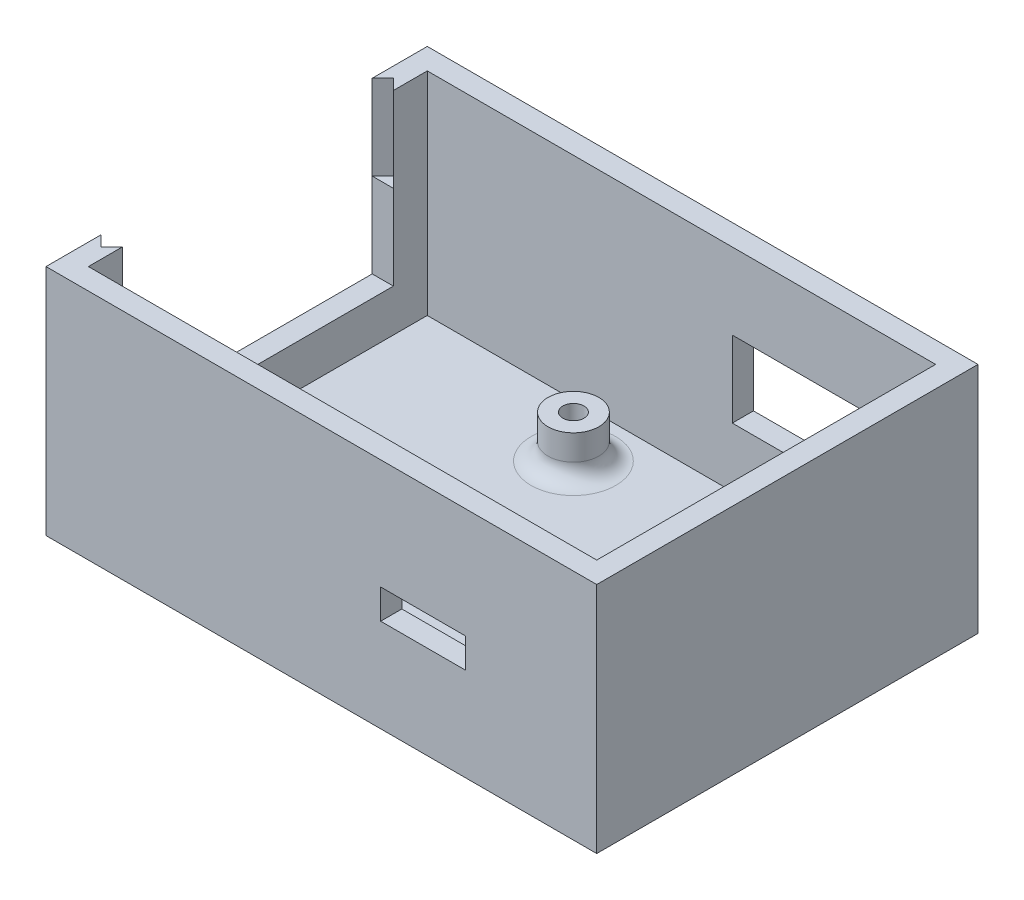
ISO-10303-21;
HEADER;
FILE_DESCRIPTION(('STEP AP214'),'2;1');
FILE_NAME('part.step','',(''),(''),'','','');
FILE_SCHEMA(('AUTOMOTIVE_DESIGN { 1 0 10303 214 1 1 1 1 }'));
ENDSEC;
DATA;
#1=APPLICATION_CONTEXT('core data for automotive mechanical design processes');
#2=APPLICATION_PROTOCOL_DEFINITION('international standard','automotive_design',2000,#1);
#3=PRODUCT_CONTEXT('',#1,'mechanical');
#4=PRODUCT('Part','Part','',(#3));
#5=PRODUCT_RELATED_PRODUCT_CATEGORY('part','',(#4));
#6=PRODUCT_DEFINITION_FORMATION('','',#4);
#7=PRODUCT_DEFINITION_CONTEXT('part definition',#1,'design');
#8=PRODUCT_DEFINITION('design','',#6,#7);
#9=PRODUCT_DEFINITION_SHAPE('','',#8);
#10=(LENGTH_UNIT() NAMED_UNIT(*) SI_UNIT(.MILLI.,.METRE.));
#11=(NAMED_UNIT(*) PLANE_ANGLE_UNIT() SI_UNIT($,.RADIAN.));
#12=(NAMED_UNIT(*) SI_UNIT($,.STERADIAN.) SOLID_ANGLE_UNIT());
#13=UNCERTAINTY_MEASURE_WITH_UNIT(LENGTH_MEASURE(1.E-05),#10,'distance_accuracy_value','');
#14=(GEOMETRIC_REPRESENTATION_CONTEXT(3) GLOBAL_UNCERTAINTY_ASSIGNED_CONTEXT((#13)) GLOBAL_UNIT_ASSIGNED_CONTEXT((#10,
#11,#12)) REPRESENTATION_CONTEXT('',''));
#15=CARTESIAN_POINT('',(0.,0.,0.));
#16=DIRECTION('',(0.,0.,1.));
#17=DIRECTION('',(1.,0.,0.));
#18=AXIS2_PLACEMENT_3D('',#15,#16,#17);
#19=CARTESIAN_POINT('',(32.5,27.5,-22.5));
#20=DIRECTION('',(-1.,0.,0.));
#21=DIRECTION('',(0.,0.,1.));
#22=AXIS2_PLACEMENT_3D('',#19,#20,#21);
#23=PLANE('',#22);
#24=DIRECTION('',(0.,0.,-1.));
#25=VECTOR('',#24,1.);
#26=CARTESIAN_POINT('',(32.5,0.,-22.5));
#27=LINE('',#26,#25);
#28=CARTESIAN_POINT('',(32.5,0.,22.5));
#29=VERTEX_POINT('',#28);
#30=CARTESIAN_POINT('',(32.5,0.,-22.5));
#31=VERTEX_POINT('',#30);
#32=EDGE_CURVE('E355',#29,#31,#27,.T.);
#33=ORIENTED_EDGE('',*,*,#32,.T.);
#34=DIRECTION('',(0.,-1.,0.));
#35=VECTOR('',#34,1.);
#36=CARTESIAN_POINT('',(32.5,27.5,-22.5));
#37=LINE('',#36,#35);
#38=CARTESIAN_POINT('',(32.5,27.5,-22.5));
#39=VERTEX_POINT('',#38);
#40=EDGE_CURVE('E408',#39,#31,#37,.T.);
#41=ORIENTED_EDGE('',*,*,#40,.F.);
#42=DIRECTION('',(0.,0.,-1.));
#43=VECTOR('',#42,1.);
#44=CARTESIAN_POINT('',(32.5,27.5,-22.5));
#45=LINE('',#44,#43);
#46=CARTESIAN_POINT('',(32.5,27.5,22.5));
#47=VERTEX_POINT('',#46);
#48=EDGE_CURVE('E380',#47,#39,#45,.T.);
#49=ORIENTED_EDGE('',*,*,#48,.F.);
#50=DIRECTION('',(0.,-1.,0.));
#51=VECTOR('',#50,1.);
#52=CARTESIAN_POINT('',(32.5,27.5,22.5));
#53=LINE('',#52,#51);
#54=EDGE_CURVE('E392',#47,#29,#53,.T.);
#55=ORIENTED_EDGE('',*,*,#54,.T.);
#56=EDGE_LOOP('',(#33,#41,#49,#55));
#57=FACE_BOUND('',#56,.T.);
#58=ADVANCED_FACE('F41',(#57),#23,.F.);
#59=CARTESIAN_POINT('',(-32.5,27.5,-22.5));
#60=DIRECTION('',(0.,0.,1.));
#61=DIRECTION('',(1.,0.,0.));
#62=AXIS2_PLACEMENT_3D('',#59,#60,#61);
#63=PLANE('',#62);
#64=DIRECTION('',(1.,0.,0.));
#65=VECTOR('',#64,1.);
#66=CARTESIAN_POINT('',(28.,9.5,-22.5));
#67=LINE('',#66,#65);
#68=CARTESIAN_POINT('',(6.00000000000001,9.5,-22.5));
#69=VERTEX_POINT('',#68);
#70=CARTESIAN_POINT('',(28.,9.5,-22.5));
#71=VERTEX_POINT('',#70);
#72=EDGE_CURVE('E249',#69,#71,#67,.T.);
#73=ORIENTED_EDGE('',*,*,#72,.T.);
#74=DIRECTION('',(0.,1.,0.));
#75=VECTOR('',#74,1.);
#76=CARTESIAN_POINT('',(28.,18.5,-22.5));
#77=LINE('',#76,#75);
#78=CARTESIAN_POINT('',(28.,18.5,-22.5));
#79=VERTEX_POINT('',#78);
#80=EDGE_CURVE('E239',#71,#79,#77,.T.);
#81=ORIENTED_EDGE('',*,*,#80,.T.);
#82=DIRECTION('',(-1.,0.,0.));
#83=VECTOR('',#82,1.);
#84=CARTESIAN_POINT('',(28.,18.5,-22.5));
#85=LINE('',#84,#83);
#86=CARTESIAN_POINT('',(6.00000000000001,18.5,-22.5));
#87=VERTEX_POINT('',#86);
#88=EDGE_CURVE('E242',#79,#87,#85,.T.);
#89=ORIENTED_EDGE('',*,*,#88,.T.);
#90=DIRECTION('',(0.,-1.,0.));
#91=VECTOR('',#90,1.);
#92=CARTESIAN_POINT('',(6.,18.5,-22.5));
#93=LINE('',#92,#91);
#94=EDGE_CURVE('E246',#87,#69,#93,.T.);
#95=ORIENTED_EDGE('',*,*,#94,.T.);
#96=EDGE_LOOP('',(#73,#81,#89,#95));
#97=FACE_BOUND('',#96,.T.);
#98=DIRECTION('',(-1.,0.,0.));
#99=VECTOR('',#98,1.);
#100=CARTESIAN_POINT('',(-32.5,0.,-22.5));
#101=LINE('',#100,#99);
#102=CARTESIAN_POINT('',(-32.5,0.,-22.5));
#103=VERTEX_POINT('',#102);
#104=EDGE_CURVE('E395',#31,#103,#101,.T.);
#105=ORIENTED_EDGE('',*,*,#104,.T.);
#106=DIRECTION('',(0.,-1.,0.));
#107=VECTOR('',#106,1.);
#108=CARTESIAN_POINT('',(-32.5,27.5,-22.5));
#109=LINE('',#108,#107);
#110=CARTESIAN_POINT('',(-32.5,27.5,-22.5));
#111=VERTEX_POINT('',#110);
#112=EDGE_CURVE('E405',#111,#103,#109,.T.);
#113=ORIENTED_EDGE('',*,*,#112,.F.);
#114=DIRECTION('',(-1.,0.,0.));
#115=VECTOR('',#114,1.);
#116=CARTESIAN_POINT('',(-32.5,27.5,-22.5));
#117=LINE('',#116,#115);
#118=EDGE_CURVE('E383',#39,#111,#117,.T.);
#119=ORIENTED_EDGE('',*,*,#118,.F.);
#120=ORIENTED_EDGE('',*,*,#40,.T.);
#121=EDGE_LOOP('',(#105,#113,#119,#120));
#122=FACE_BOUND('',#121,.T.);
#123=ADVANCED_FACE('F450',(#97,#122),#63,.F.);
#124=CARTESIAN_POINT('',(-32.5,27.5,-22.5));
#125=DIRECTION('',(1.,0.,0.));
#126=DIRECTION('',(0.,0.,-1.));
#127=AXIS2_PLACEMENT_3D('',#124,#125,#126);
#128=PLANE('',#127);
#129=DIRECTION('',(0.,0.,-1.));
#130=VECTOR('',#129,1.);
#131=CARTESIAN_POINT('',(-32.5,7.5,-16.));
#132=LINE('',#131,#130);
#133=CARTESIAN_POINT('',(-32.5,7.5,16.));
#134=VERTEX_POINT('',#133);
#135=CARTESIAN_POINT('',(-32.5,7.5,-16.));
#136=VERTEX_POINT('',#135);
#137=EDGE_CURVE('E333',#134,#136,#132,.T.);
#138=ORIENTED_EDGE('',*,*,#137,.T.);
#139=DIRECTION('',(0.,1.,0.));
#140=VECTOR('',#139,1.);
#141=CARTESIAN_POINT('',(-32.5,27.5,-16.));
#142=LINE('',#141,#140);
#143=CARTESIAN_POINT('',(-32.5,17.5,-16.));
#144=VERTEX_POINT('',#143);
#145=EDGE_CURVE('E325',#136,#144,#142,.T.);
#146=ORIENTED_EDGE('',*,*,#145,.T.);
#147=DIRECTION('',(0.,1.,0.));
#148=VECTOR('',#147,1.);
#149=CARTESIAN_POINT('',(-32.5,4.70491502812523,-16.));
#150=LINE('',#149,#148);
#151=CARTESIAN_POINT('',(-32.5,27.5,-16.));
#152=VERTEX_POINT('',#151);
#153=EDGE_CURVE('E303',#144,#152,#150,.T.);
#154=ORIENTED_EDGE('',*,*,#153,.T.);
#155=DIRECTION('',(0.,0.,1.));
#156=VECTOR('',#155,1.);
#157=CARTESIAN_POINT('',(-32.5,27.5,-22.5));
#158=LINE('',#157,#156);
#159=EDGE_CURVE('E387',#111,#152,#158,.T.);
#160=ORIENTED_EDGE('',*,*,#159,.F.);
#161=ORIENTED_EDGE('',*,*,#112,.T.);
#162=DIRECTION('',(0.,0.,1.));
#163=VECTOR('',#162,1.);
#164=CARTESIAN_POINT('',(-32.5,0.,-22.5));
#165=LINE('',#164,#163);
#166=CARTESIAN_POINT('',(-32.5,0.,22.5));
#167=VERTEX_POINT('',#166);
#168=EDGE_CURVE('E397',#103,#167,#165,.T.);
#169=ORIENTED_EDGE('',*,*,#168,.T.);
#170=DIRECTION('',(0.,-1.,0.));
#171=VECTOR('',#170,1.);
#172=CARTESIAN_POINT('',(-32.5,27.5,22.5));
#173=LINE('',#172,#171);
#174=CARTESIAN_POINT('',(-32.5,27.5,22.5));
#175=VERTEX_POINT('',#174);
#176=EDGE_CURVE('E402',#175,#167,#173,.T.);
#177=ORIENTED_EDGE('',*,*,#176,.F.);
#178=CARTESIAN_POINT('',(-32.5,27.5,16.));
#179=VERTEX_POINT('',#178);
#180=EDGE_CURVE('E386',#179,#175,#158,.T.);
#181=ORIENTED_EDGE('',*,*,#180,.F.);
#182=DIRECTION('',(0.,-1.,0.));
#183=VECTOR('',#182,1.);
#184=CARTESIAN_POINT('',(-32.5,27.5,16.));
#185=LINE('',#184,#183);
#186=CARTESIAN_POINT('',(-32.5,17.5,16.));
#187=VERTEX_POINT('',#186);
#188=EDGE_CURVE('E330',#179,#187,#185,.T.);
#189=ORIENTED_EDGE('',*,*,#188,.T.);
#190=EDGE_CURVE('E328',#187,#134,#185,.T.);
#191=ORIENTED_EDGE('',*,*,#190,.T.);
#192=EDGE_LOOP('',(#138,#146,#154,#160,#161,#169,#177,#181,#189,#191));
#193=FACE_BOUND('',#192,.T.);
#194=ADVANCED_FACE('F456',(#193),#128,.F.);
#195=CARTESIAN_POINT('',(-32.5,27.5,22.5));
#196=DIRECTION('',(0.,0.,-1.));
#197=DIRECTION('',(-1.,0.,0.));
#198=AXIS2_PLACEMENT_3D('',#195,#196,#197);
#199=PLANE('',#198);
#200=DIRECTION('',(-1.,0.,0.));
#201=VECTOR('',#200,1.);
#202=CARTESIAN_POINT('',(6.99999999999999,11.,22.5));
#203=LINE('',#202,#201);
#204=CARTESIAN_POINT('',(17.,11.,22.5));
#205=VERTEX_POINT('',#204);
#206=CARTESIAN_POINT('',(6.99999999999999,11.,22.5));
#207=VERTEX_POINT('',#206);
#208=EDGE_CURVE('E210',#205,#207,#203,.T.);
#209=ORIENTED_EDGE('',*,*,#208,.T.);
#210=DIRECTION('',(0.,1.,0.));
#211=VECTOR('',#210,1.);
#212=CARTESIAN_POINT('',(6.99999999999999,14.5,22.5));
#213=LINE('',#212,#211);
#214=CARTESIAN_POINT('',(6.99999999999999,14.5,22.5));
#215=VERTEX_POINT('',#214);
#216=EDGE_CURVE('E204',#207,#215,#213,.T.);
#217=ORIENTED_EDGE('',*,*,#216,.T.);
#218=DIRECTION('',(1.,0.,0.));
#219=VECTOR('',#218,1.);
#220=CARTESIAN_POINT('',(6.99999999999999,14.5,22.5));
#221=LINE('',#220,#219);
#222=CARTESIAN_POINT('',(17.,14.5,22.5));
#223=VERTEX_POINT('',#222);
#224=EDGE_CURVE('E213',#215,#223,#221,.T.);
#225=ORIENTED_EDGE('',*,*,#224,.T.);
#226=DIRECTION('',(0.,-1.,0.));
#227=VECTOR('',#226,1.);
#228=CARTESIAN_POINT('',(17.,14.5,22.5));
#229=LINE('',#228,#227);
#230=EDGE_CURVE('E56',#223,#205,#229,.T.);
#231=ORIENTED_EDGE('',*,*,#230,.T.);
#232=EDGE_LOOP('',(#209,#217,#225,#231));
#233=FACE_BOUND('',#232,.T.);
#234=DIRECTION('',(1.,0.,0.));
#235=VECTOR('',#234,1.);
#236=CARTESIAN_POINT('',(-32.5,0.,22.5));
#237=LINE('',#236,#235);
#238=EDGE_CURVE('E384',#167,#29,#237,.T.);
#239=ORIENTED_EDGE('',*,*,#238,.T.);
#240=ORIENTED_EDGE('',*,*,#54,.F.);
#241=DIRECTION('',(1.,0.,0.));
#242=VECTOR('',#241,1.);
#243=CARTESIAN_POINT('',(-32.5,27.5,22.5));
#244=LINE('',#243,#242);
#245=EDGE_CURVE('E390',#175,#47,#244,.T.);
#246=ORIENTED_EDGE('',*,*,#245,.F.);
#247=ORIENTED_EDGE('',*,*,#176,.T.);
#248=EDGE_LOOP('',(#239,#240,#246,#247));
#249=FACE_BOUND('',#248,.T.);
#250=ADVANCED_FACE('F217',(#233,#249),#199,.F.);
#251=CARTESIAN_POINT('',(0.,27.5,0.));
#252=DIRECTION('',(0.,1.,0.));
#253=DIRECTION('',(0.,0.,1.));
#254=AXIS2_PLACEMENT_3D('',#251,#252,#253);
#255=PLANE('',#254);
#256=DIRECTION('',(-0.707106781186547,0.,-0.707106781186549));
#257=VECTOR('',#256,1.);
#258=CARTESIAN_POINT('',(-31.25,27.5,-17.25));
#259=LINE('',#258,#257);
#260=CARTESIAN_POINT('',(-30.,27.5,-16.));
#261=VERTEX_POINT('',#260);
#262=CARTESIAN_POINT('',(-31.25,27.5,-17.25));
#263=VERTEX_POINT('',#262);
#264=EDGE_CURVE('E292',#261,#263,#259,.T.);
#265=ORIENTED_EDGE('',*,*,#264,.F.);
#266=DIRECTION('',(0.,0.,1.));
#267=VECTOR('',#266,1.);
#268=CARTESIAN_POINT('',(-30.,27.5,-22.5));
#269=LINE('',#268,#267);
#270=CARTESIAN_POINT('',(-30.,27.5,-20.));
#271=VERTEX_POINT('',#270);
#272=EDGE_CURVE('E376',#271,#261,#269,.T.);
#273=ORIENTED_EDGE('',*,*,#272,.F.);
#274=DIRECTION('',(-1.,0.,0.));
#275=VECTOR('',#274,1.);
#276=CARTESIAN_POINT('',(-32.5,27.5,-20.));
#277=LINE('',#276,#275);
#278=CARTESIAN_POINT('',(30.,27.5,-20.));
#279=VERTEX_POINT('',#278);
#280=EDGE_CURVE('E373',#279,#271,#277,.T.);
#281=ORIENTED_EDGE('',*,*,#280,.F.);
#282=DIRECTION('',(0.,0.,-1.));
#283=VECTOR('',#282,1.);
#284=CARTESIAN_POINT('',(30.,27.5,-22.5));
#285=LINE('',#284,#283);
#286=CARTESIAN_POINT('',(30.,27.5,20.));
#287=VERTEX_POINT('',#286);
#288=EDGE_CURVE('E371',#287,#279,#285,.T.);
#289=ORIENTED_EDGE('',*,*,#288,.F.);
#290=DIRECTION('',(1.,0.,0.));
#291=VECTOR('',#290,1.);
#292=CARTESIAN_POINT('',(-32.5,27.5,20.));
#293=LINE('',#292,#291);
#294=CARTESIAN_POINT('',(-30.,27.5,20.));
#295=VERTEX_POINT('',#294);
#296=EDGE_CURVE('E361',#295,#287,#293,.T.);
#297=ORIENTED_EDGE('',*,*,#296,.F.);
#298=CARTESIAN_POINT('',(-30.,27.5,16.));
#299=VERTEX_POINT('',#298);
#300=EDGE_CURVE('E375',#299,#295,#269,.T.);
#301=ORIENTED_EDGE('',*,*,#300,.F.);
#302=DIRECTION('',(0.707106781186541,0.,-0.707106781186554));
#303=VECTOR('',#302,1.);
#304=CARTESIAN_POINT('',(-30.,27.5,16.));
#305=LINE('',#304,#303);
#306=CARTESIAN_POINT('',(-31.25,27.5,17.25));
#307=VERTEX_POINT('',#306);
#308=EDGE_CURVE('E312',#307,#299,#305,.T.);
#309=ORIENTED_EDGE('',*,*,#308,.F.);
#310=DIRECTION('',(0.707106781186541,0.,0.707106781186554));
#311=VECTOR('',#310,1.);
#312=CARTESIAN_POINT('',(-31.25,27.5,17.25));
#313=LINE('',#312,#311);
#314=EDGE_CURVE('E288',#179,#307,#313,.T.);
#315=ORIENTED_EDGE('',*,*,#314,.F.);
#316=ORIENTED_EDGE('',*,*,#180,.T.);
#317=ORIENTED_EDGE('',*,*,#245,.T.);
#318=ORIENTED_EDGE('',*,*,#48,.T.);
#319=ORIENTED_EDGE('',*,*,#118,.T.);
#320=ORIENTED_EDGE('',*,*,#159,.T.);
#321=DIRECTION('',(-0.707106781186547,0.,0.707106781186547));
#322=VECTOR('',#321,1.);
#323=CARTESIAN_POINT('',(-32.5,27.5,-16.));
#324=LINE('',#323,#322);
#325=EDGE_CURVE('E289',#263,#152,#324,.T.);
#326=ORIENTED_EDGE('',*,*,#325,.F.);
#327=EDGE_LOOP('',(#265,#273,#281,#289,#297,#301,#309,#315,#316,#317,#318,#319,#320,#326));
#328=FACE_BOUND('',#327,.T.);
#329=ADVANCED_FACE('F465',(#328),#255,.T.);
#330=CARTESIAN_POINT('',(0.,0.,0.));
#331=DIRECTION('',(0.,1.,0.));
#332=DIRECTION('',(0.,0.,1.));
#333=AXIS2_PLACEMENT_3D('',#330,#331,#332);
#334=PLANE('',#333);
#335=ORIENTED_EDGE('',*,*,#32,.F.);
#336=ORIENTED_EDGE('',*,*,#238,.F.);
#337=ORIENTED_EDGE('',*,*,#168,.F.);
#338=ORIENTED_EDGE('',*,*,#104,.F.);
#339=EDGE_LOOP('',(#335,#336,#337,#338));
#340=FACE_BOUND('',#339,.T.);
#341=ADVANCED_FACE('F466',(#340),#334,.F.);
#342=CARTESIAN_POINT('',(30.,27.5,-22.5));
#343=DIRECTION('',(-1.,0.,0.));
#344=DIRECTION('',(0.,0.,1.));
#345=AXIS2_PLACEMENT_3D('',#342,#343,#344);
#346=PLANE('',#345);
#347=DIRECTION('',(0.,0.,-1.));
#348=VECTOR('',#347,1.);
#349=CARTESIAN_POINT('',(30.,2.5,-22.5));
#350=LINE('',#349,#348);
#351=CARTESIAN_POINT('',(30.,2.5,20.));
#352=VERTEX_POINT('',#351);
#353=CARTESIAN_POINT('',(30.,2.5,-20.));
#354=VERTEX_POINT('',#353);
#355=EDGE_CURVE('E346',#352,#354,#350,.T.);
#356=ORIENTED_EDGE('',*,*,#355,.F.);
#357=DIRECTION('',(0.,-1.,0.));
#358=VECTOR('',#357,1.);
#359=CARTESIAN_POINT('',(30.,27.5,20.));
#360=LINE('',#359,#358);
#361=EDGE_CURVE('E357',#287,#352,#360,.T.);
#362=ORIENTED_EDGE('',*,*,#361,.F.);
#363=ORIENTED_EDGE('',*,*,#288,.T.);
#364=DIRECTION('',(0.,-1.,0.));
#365=VECTOR('',#364,1.);
#366=CARTESIAN_POINT('',(30.,27.5,-20.));
#367=LINE('',#366,#365);
#368=EDGE_CURVE('E352',#279,#354,#367,.T.);
#369=ORIENTED_EDGE('',*,*,#368,.T.);
#370=EDGE_LOOP('',(#356,#362,#363,#369));
#371=FACE_BOUND('',#370,.T.);
#372=ADVANCED_FACE('F469',(#371),#346,.T.);
#373=CARTESIAN_POINT('',(-32.5,27.5,-20.));
#374=DIRECTION('',(0.,0.,1.));
#375=DIRECTION('',(1.,0.,0.));
#376=AXIS2_PLACEMENT_3D('',#373,#374,#375);
#377=PLANE('',#376);
#378=DIRECTION('',(0.,1.,0.));
#379=VECTOR('',#378,1.);
#380=CARTESIAN_POINT('',(28.,18.5,-20.));
#381=LINE('',#380,#379);
#382=CARTESIAN_POINT('',(28.,9.5,-20.));
#383=VERTEX_POINT('',#382);
#384=CARTESIAN_POINT('',(28.,18.5,-20.));
#385=VERTEX_POINT('',#384);
#386=EDGE_CURVE('E235',#383,#385,#381,.T.);
#387=ORIENTED_EDGE('',*,*,#386,.F.);
#388=DIRECTION('',(1.,0.,0.));
#389=VECTOR('',#388,1.);
#390=CARTESIAN_POINT('',(28.,9.5,-20.));
#391=LINE('',#390,#389);
#392=CARTESIAN_POINT('',(6.00000000000001,9.5,-20.));
#393=VERTEX_POINT('',#392);
#394=EDGE_CURVE('E243',#393,#383,#391,.T.);
#395=ORIENTED_EDGE('',*,*,#394,.F.);
#396=DIRECTION('',(0.,-1.,0.));
#397=VECTOR('',#396,1.);
#398=CARTESIAN_POINT('',(6.,18.5,-20.));
#399=LINE('',#398,#397);
#400=CARTESIAN_POINT('',(6.,18.5,-20.));
#401=VERTEX_POINT('',#400);
#402=EDGE_CURVE('E257',#401,#393,#399,.T.);
#403=ORIENTED_EDGE('',*,*,#402,.F.);
#404=DIRECTION('',(-1.,0.,0.));
#405=VECTOR('',#404,1.);
#406=CARTESIAN_POINT('',(28.,18.5,-20.));
#407=LINE('',#406,#405);
#408=EDGE_CURVE('E254',#385,#401,#407,.T.);
#409=ORIENTED_EDGE('',*,*,#408,.F.);
#410=EDGE_LOOP('',(#387,#395,#403,#409));
#411=FACE_BOUND('',#410,.T.);
#412=DIRECTION('',(-1.,0.,0.));
#413=VECTOR('',#412,1.);
#414=CARTESIAN_POINT('',(-32.5,2.5,-20.));
#415=LINE('',#414,#413);
#416=CARTESIAN_POINT('',(-30.,2.5,-20.));
#417=VERTEX_POINT('',#416);
#418=EDGE_CURVE('E351',#354,#417,#415,.T.);
#419=ORIENTED_EDGE('',*,*,#418,.F.);
#420=ORIENTED_EDGE('',*,*,#368,.F.);
#421=ORIENTED_EDGE('',*,*,#280,.T.);
#422=DIRECTION('',(0.,-1.,0.));
#423=VECTOR('',#422,1.);
#424=CARTESIAN_POINT('',(-30.,27.5,-20.));
#425=LINE('',#424,#423);
#426=EDGE_CURVE('E356',#271,#417,#425,.T.);
#427=ORIENTED_EDGE('',*,*,#426,.T.);
#428=EDGE_LOOP('',(#419,#420,#421,#427));
#429=FACE_BOUND('',#428,.T.);
#430=ADVANCED_FACE('F488',(#411,#429),#377,.T.);
#431=CARTESIAN_POINT('',(-30.,27.5,-22.5));
#432=DIRECTION('',(1.,0.,0.));
#433=DIRECTION('',(0.,0.,-1.));
#434=AXIS2_PLACEMENT_3D('',#431,#432,#433);
#435=PLANE('',#434);
#436=DIRECTION('',(0.,1.,0.));
#437=VECTOR('',#436,1.);
#438=CARTESIAN_POINT('',(-30.,27.5,-16.));
#439=LINE('',#438,#437);
#440=CARTESIAN_POINT('',(-30.,7.5,-16.));
#441=VERTEX_POINT('',#440);
#442=CARTESIAN_POINT('',(-30.,17.5,-16.));
#443=VERTEX_POINT('',#442);
#444=EDGE_CURVE('E311',#441,#443,#439,.T.);
#445=ORIENTED_EDGE('',*,*,#444,.F.);
#446=DIRECTION('',(0.,0.,-1.));
#447=VECTOR('',#446,1.);
#448=CARTESIAN_POINT('',(-30.,7.5,-16.));
#449=LINE('',#448,#447);
#450=CARTESIAN_POINT('',(-30.,7.5,16.));
#451=VERTEX_POINT('',#450);
#452=EDGE_CURVE('E329',#451,#441,#449,.T.);
#453=ORIENTED_EDGE('',*,*,#452,.F.);
#454=DIRECTION('',(0.,-1.,0.));
#455=VECTOR('',#454,1.);
#456=CARTESIAN_POINT('',(-30.,27.5,16.));
#457=LINE('',#456,#455);
#458=CARTESIAN_POINT('',(-30.,17.5,16.));
#459=VERTEX_POINT('',#458);
#460=EDGE_CURVE('E339',#459,#451,#457,.T.);
#461=ORIENTED_EDGE('',*,*,#460,.F.);
#462=EDGE_CURVE('E340',#299,#459,#457,.T.);
#463=ORIENTED_EDGE('',*,*,#462,.F.);
#464=ORIENTED_EDGE('',*,*,#300,.T.);
#465=DIRECTION('',(0.,-1.,0.));
#466=VECTOR('',#465,1.);
#467=CARTESIAN_POINT('',(-30.,27.5,20.));
#468=LINE('',#467,#466);
#469=CARTESIAN_POINT('',(-30.,2.5,20.));
#470=VERTEX_POINT('',#469);
#471=EDGE_CURVE('E360',#295,#470,#468,.T.);
#472=ORIENTED_EDGE('',*,*,#471,.T.);
#473=DIRECTION('',(0.,0.,1.));
#474=VECTOR('',#473,1.);
#475=CARTESIAN_POINT('',(-30.,2.5,-22.5));
#476=LINE('',#475,#474);
#477=EDGE_CURVE('E363',#417,#470,#476,.T.);
#478=ORIENTED_EDGE('',*,*,#477,.F.);
#479=ORIENTED_EDGE('',*,*,#426,.F.);
#480=ORIENTED_EDGE('',*,*,#272,.T.);
#481=DIRECTION('',(0.,1.,0.));
#482=VECTOR('',#481,1.);
#483=CARTESIAN_POINT('',(-30.,4.70491502812523,-16.));
#484=LINE('',#483,#482);
#485=EDGE_CURVE('E302',#443,#261,#484,.T.);
#486=ORIENTED_EDGE('',*,*,#485,.F.);
#487=EDGE_LOOP('',(#445,#453,#461,#463,#464,#472,#478,#479,#480,#486));
#488=FACE_BOUND('',#487,.T.);
#489=ADVANCED_FACE('F484',(#488),#435,.T.);
#490=CARTESIAN_POINT('',(-32.5,27.5,20.));
#491=DIRECTION('',(0.,0.,-1.));
#492=DIRECTION('',(-1.,0.,0.));
#493=AXIS2_PLACEMENT_3D('',#490,#491,#492);
#494=PLANE('',#493);
#495=DIRECTION('',(0.,1.,0.));
#496=VECTOR('',#495,1.);
#497=CARTESIAN_POINT('',(6.99999999999999,14.5,20.));
#498=LINE('',#497,#496);
#499=CARTESIAN_POINT('',(6.99999999999999,11.,20.));
#500=VERTEX_POINT('',#499);
#501=CARTESIAN_POINT('',(6.99999999999999,14.5,20.));
#502=VERTEX_POINT('',#501);
#503=EDGE_CURVE('E64',#500,#502,#498,.T.);
#504=ORIENTED_EDGE('',*,*,#503,.F.);
#505=DIRECTION('',(-1.,0.,0.));
#506=VECTOR('',#505,1.);
#507=CARTESIAN_POINT('',(6.99999999999999,11.,20.));
#508=LINE('',#507,#506);
#509=CARTESIAN_POINT('',(17.,11.,20.));
#510=VERTEX_POINT('',#509);
#511=EDGE_CURVE('E220',#510,#500,#508,.T.);
#512=ORIENTED_EDGE('',*,*,#511,.F.);
#513=DIRECTION('',(0.,-1.,0.));
#514=VECTOR('',#513,1.);
#515=CARTESIAN_POINT('',(17.,14.5,20.));
#516=LINE('',#515,#514);
#517=CARTESIAN_POINT('',(17.,14.5,20.));
#518=VERTEX_POINT('',#517);
#519=EDGE_CURVE('E223',#518,#510,#516,.T.);
#520=ORIENTED_EDGE('',*,*,#519,.F.);
#521=DIRECTION('',(1.,0.,0.));
#522=VECTOR('',#521,1.);
#523=CARTESIAN_POINT('',(6.99999999999999,14.5,20.));
#524=LINE('',#523,#522);
#525=EDGE_CURVE('E229',#502,#518,#524,.T.);
#526=ORIENTED_EDGE('',*,*,#525,.F.);
#527=EDGE_LOOP('',(#504,#512,#520,#526));
#528=FACE_BOUND('',#527,.T.);
#529=DIRECTION('',(1.,0.,0.));
#530=VECTOR('',#529,1.);
#531=CARTESIAN_POINT('',(-32.5,2.5,20.));
#532=LINE('',#531,#530);
#533=EDGE_CURVE('E367',#470,#352,#532,.T.);
#534=ORIENTED_EDGE('',*,*,#533,.F.);
#535=ORIENTED_EDGE('',*,*,#471,.F.);
#536=ORIENTED_EDGE('',*,*,#296,.T.);
#537=ORIENTED_EDGE('',*,*,#361,.T.);
#538=EDGE_LOOP('',(#534,#535,#536,#537));
#539=FACE_BOUND('',#538,.T.);
#540=ADVANCED_FACE('F478',(#528,#539),#494,.T.);
#541=CARTESIAN_POINT('',(0.,2.5,0.));
#542=DIRECTION('',(0.,1.,0.));
#543=DIRECTION('',(0.,0.,1.));
#544=AXIS2_PLACEMENT_3D('',#541,#542,#543);
#545=PLANE('',#544);
#546=CARTESIAN_POINT('',(20.,2.5,7.));
#547=DIRECTION('',(0.,1.,0.));
#548=DIRECTION('',(0.,0.,1.));
#549=AXIS2_PLACEMENT_3D('',#546,#547,#548);
#550=CIRCLE('',#549,5.);
#551=CARTESIAN_POINT('',(20.,2.5,12.));
#552=VERTEX_POINT('',#551);
#553=EDGE_CURVE('E429',#552,#552,#550,.F.);
#554=ORIENTED_EDGE('',*,*,#553,.T.);
#555=EDGE_LOOP('',(#554));
#556=FACE_BOUND('',#555,.T.);
#557=CARTESIAN_POINT('',(-6.50000000000001,2.5,13.75));
#558=DIRECTION('',(0.,1.,0.));
#559=DIRECTION('',(0.,0.,1.));
#560=AXIS2_PLACEMENT_3D('',#557,#558,#559);
#561=CIRCLE('',#560,5.);
#562=CARTESIAN_POINT('',(-6.50000000000001,2.5,18.75));
#563=VERTEX_POINT('',#562);
#564=EDGE_CURVE('E426',#563,#563,#561,.F.);
#565=ORIENTED_EDGE('',*,*,#564,.T.);
#566=EDGE_LOOP('',(#565));
#567=FACE_BOUND('',#566,.T.);
#568=CARTESIAN_POINT('',(-6.50000000000001,2.5,-13.75));
#569=DIRECTION('',(0.,1.,0.));
#570=DIRECTION('',(0.,0.,1.));
#571=AXIS2_PLACEMENT_3D('',#568,#569,#570);
#572=CIRCLE('',#571,5.);
#573=CARTESIAN_POINT('',(-6.50000000000001,2.5,-8.75));
#574=VERTEX_POINT('',#573);
#575=EDGE_CURVE('E423',#574,#574,#572,.F.);
#576=ORIENTED_EDGE('',*,*,#575,.T.);
#577=EDGE_LOOP('',(#576));
#578=FACE_BOUND('',#577,.T.);
#579=ORIENTED_EDGE('',*,*,#355,.T.);
#580=ORIENTED_EDGE('',*,*,#418,.T.);
#581=ORIENTED_EDGE('',*,*,#477,.T.);
#582=ORIENTED_EDGE('',*,*,#533,.T.);
#583=EDGE_LOOP('',(#579,#580,#581,#582));
#584=FACE_BOUND('',#583,.T.);
#585=ADVANCED_FACE('F474',(#556,#567,#578,#584),#545,.T.);
#586=CARTESIAN_POINT('',(-32.5,27.5,-16.));
#587=DIRECTION('',(0.,0.,-1.));
#588=DIRECTION('',(-1.,0.,0.));
#589=AXIS2_PLACEMENT_3D('',#586,#587,#588);
#590=PLANE('',#589);
#591=ORIENTED_EDGE('',*,*,#444,.T.);
#592=DIRECTION('',(1.,0.,0.));
#593=VECTOR('',#592,1.);
#594=CARTESIAN_POINT('',(-32.5,17.5,-16.));
#595=LINE('',#594,#593);
#596=EDGE_CURVE('E299',#144,#443,#595,.T.);
#597=ORIENTED_EDGE('',*,*,#596,.F.);
#598=ORIENTED_EDGE('',*,*,#145,.F.);
#599=DIRECTION('',(1.,0.,0.));
#600=VECTOR('',#599,1.);
#601=CARTESIAN_POINT('',(-32.5,7.5,-16.));
#602=LINE('',#601,#600);
#603=EDGE_CURVE('E344',#136,#441,#602,.T.);
#604=ORIENTED_EDGE('',*,*,#603,.T.);
#605=EDGE_LOOP('',(#591,#597,#598,#604));
#606=FACE_BOUND('',#605,.T.);
#607=ADVANCED_FACE('F477',(#606),#590,.F.);
#608=CARTESIAN_POINT('',(-32.5,7.5,-16.));
#609=DIRECTION('',(0.,-1.,0.));
#610=DIRECTION('',(0.,0.,-1.));
#611=AXIS2_PLACEMENT_3D('',#608,#609,#610);
#612=PLANE('',#611);
#613=ORIENTED_EDGE('',*,*,#452,.T.);
#614=ORIENTED_EDGE('',*,*,#603,.F.);
#615=ORIENTED_EDGE('',*,*,#137,.F.);
#616=DIRECTION('',(1.,0.,0.));
#617=VECTOR('',#616,1.);
#618=CARTESIAN_POINT('',(-32.5,7.5,16.));
#619=LINE('',#618,#617);
#620=EDGE_CURVE('E336',#134,#451,#619,.T.);
#621=ORIENTED_EDGE('',*,*,#620,.T.);
#622=EDGE_LOOP('',(#613,#614,#615,#621));
#623=FACE_BOUND('',#622,.T.);
#624=ADVANCED_FACE('F498',(#623),#612,.F.);
#625=CARTESIAN_POINT('',(-32.5,27.5,16.));
#626=DIRECTION('',(0.,0.,1.));
#627=DIRECTION('',(1.,0.,0.));
#628=AXIS2_PLACEMENT_3D('',#625,#626,#627);
#629=PLANE('',#628);
#630=ORIENTED_EDGE('',*,*,#190,.F.);
#631=DIRECTION('',(-1.,0.,0.));
#632=VECTOR('',#631,1.);
#633=CARTESIAN_POINT('',(-32.5,17.5,16.));
#634=LINE('',#633,#632);
#635=EDGE_CURVE('E319',#459,#187,#634,.T.);
#636=ORIENTED_EDGE('',*,*,#635,.F.);
#637=ORIENTED_EDGE('',*,*,#460,.T.);
#638=ORIENTED_EDGE('',*,*,#620,.F.);
#639=EDGE_LOOP('',(#630,#636,#637,#638));
#640=FACE_BOUND('',#639,.T.);
#641=ADVANCED_FACE('F500',(#640),#629,.F.);
#642=CARTESIAN_POINT('',(-32.5,17.5,-16.));
#643=DIRECTION('',(0.,-1.,0.));
#644=DIRECTION('',(0.,0.,-1.));
#645=AXIS2_PLACEMENT_3D('',#642,#643,#644);
#646=PLANE('',#645);
#647=DIRECTION('',(0.707106781186541,0.,0.707106781186554));
#648=VECTOR('',#647,1.);
#649=CARTESIAN_POINT('',(-31.25,17.5,17.25));
#650=LINE('',#649,#648);
#651=CARTESIAN_POINT('',(-31.25,17.5,17.25));
#652=VERTEX_POINT('',#651);
#653=EDGE_CURVE('E320',#187,#652,#650,.T.);
#654=ORIENTED_EDGE('',*,*,#653,.T.);
#655=DIRECTION('',(0.707106781186541,0.,-0.707106781186554));
#656=VECTOR('',#655,1.);
#657=CARTESIAN_POINT('',(-30.,17.5,16.));
#658=LINE('',#657,#656);
#659=EDGE_CURVE('E314',#652,#459,#658,.T.);
#660=ORIENTED_EDGE('',*,*,#659,.T.);
#661=ORIENTED_EDGE('',*,*,#635,.T.);
#662=EDGE_LOOP('',(#654,#660,#661));
#663=FACE_BOUND('',#662,.T.);
#664=ADVANCED_FACE('F503',(#663),#646,.F.);
#665=CARTESIAN_POINT('',(-30.,4.70491502812523,16.));
#666=DIRECTION('',(0.707106781186554,0.,0.707106781186541));
#667=DIRECTION('',(0.707106781186541,0.,-0.707106781186554));
#668=AXIS2_PLACEMENT_3D('',#665,#666,#667);
#669=PLANE('',#668);
#670=DIRECTION('',(0.,1.,0.));
#671=VECTOR('',#670,1.);
#672=CARTESIAN_POINT('',(-31.25,4.70491502812523,17.25));
#673=LINE('',#672,#671);
#674=EDGE_CURVE('E295',#652,#307,#673,.T.);
#675=ORIENTED_EDGE('',*,*,#674,.T.);
#676=ORIENTED_EDGE('',*,*,#308,.T.);
#677=ORIENTED_EDGE('',*,*,#462,.T.);
#678=ORIENTED_EDGE('',*,*,#659,.F.);
#679=EDGE_LOOP('',(#675,#676,#677,#678));
#680=FACE_BOUND('',#679,.T.);
#681=ADVANCED_FACE('F510',(#680),#669,.F.);
#682=CARTESIAN_POINT('',(-31.25,4.70491502812523,17.25));
#683=DIRECTION('',(-0.707106781186554,0.,0.707106781186541));
#684=DIRECTION('',(0.707106781186541,0.,0.707106781186554));
#685=AXIS2_PLACEMENT_3D('',#682,#683,#684);
#686=PLANE('',#685);
#687=ORIENTED_EDGE('',*,*,#188,.F.);
#688=ORIENTED_EDGE('',*,*,#314,.T.);
#689=ORIENTED_EDGE('',*,*,#674,.F.);
#690=ORIENTED_EDGE('',*,*,#653,.F.);
#691=EDGE_LOOP('',(#687,#688,#689,#690));
#692=FACE_BOUND('',#691,.T.);
#693=ADVANCED_FACE('F514',(#692),#686,.F.);
#694=CARTESIAN_POINT('',(-32.5,17.5,-16.));
#695=DIRECTION('',(0.,-1.,0.));
#696=DIRECTION('',(0.,0.,-1.));
#697=AXIS2_PLACEMENT_3D('',#694,#695,#696);
#698=PLANE('',#697);
#699=ORIENTED_EDGE('',*,*,#596,.T.);
#700=DIRECTION('',(-0.707106781186547,0.,-0.707106781186549));
#701=VECTOR('',#700,1.);
#702=CARTESIAN_POINT('',(-31.25,17.5,-17.25));
#703=LINE('',#702,#701);
#704=CARTESIAN_POINT('',(-31.25,17.5,-17.25));
#705=VERTEX_POINT('',#704);
#706=EDGE_CURVE('E291',#443,#705,#703,.T.);
#707=ORIENTED_EDGE('',*,*,#706,.T.);
#708=DIRECTION('',(-0.707106781186548,0.,0.707106781186548));
#709=VECTOR('',#708,1.);
#710=CARTESIAN_POINT('',(-32.5,17.5,-16.));
#711=LINE('',#710,#709);
#712=EDGE_CURVE('E304',#705,#144,#711,.T.);
#713=ORIENTED_EDGE('',*,*,#712,.T.);
#714=EDGE_LOOP('',(#699,#707,#713));
#715=FACE_BOUND('',#714,.T.);
#716=ADVANCED_FACE('F518',(#715),#698,.F.);
#717=CARTESIAN_POINT('',(-31.25,4.70491502812523,-17.25));
#718=DIRECTION('',(0.707106781186548,0.,-0.707106781186546));
#719=DIRECTION('',(-0.707106781186547,0.,-0.707106781186549));
#720=AXIS2_PLACEMENT_3D('',#717,#718,#719);
#721=PLANE('',#720);
#722=ORIENTED_EDGE('',*,*,#485,.T.);
#723=ORIENTED_EDGE('',*,*,#264,.T.);
#724=DIRECTION('',(0.,1.,0.));
#725=VECTOR('',#724,1.);
#726=CARTESIAN_POINT('',(-31.25,4.70491502812523,-17.25));
#727=LINE('',#726,#725);
#728=EDGE_CURVE('E298',#705,#263,#727,.T.);
#729=ORIENTED_EDGE('',*,*,#728,.F.);
#730=ORIENTED_EDGE('',*,*,#706,.F.);
#731=EDGE_LOOP('',(#722,#723,#729,#730));
#732=FACE_BOUND('',#731,.T.);
#733=ADVANCED_FACE('F522',(#732),#721,.F.);
#734=CARTESIAN_POINT('',(-32.5,4.70491502812523,-16.));
#735=DIRECTION('',(-0.707106781186547,0.,-0.707106781186547));
#736=DIRECTION('',(-0.707106781186548,0.,0.707106781186548));
#737=AXIS2_PLACEMENT_3D('',#734,#735,#736);
#738=PLANE('',#737);
#739=ORIENTED_EDGE('',*,*,#728,.T.);
#740=ORIENTED_EDGE('',*,*,#325,.T.);
#741=ORIENTED_EDGE('',*,*,#153,.F.);
#742=ORIENTED_EDGE('',*,*,#712,.F.);
#743=EDGE_LOOP('',(#739,#740,#741,#742));
#744=FACE_BOUND('',#743,.T.);
#745=ADVANCED_FACE('F526',(#744),#738,.F.);
#746=CARTESIAN_POINT('',(-6.50000000000001,7.5,-13.75));
#747=DIRECTION('',(0.,1.,0.));
#748=DIRECTION('',(0.,0.,1.));
#749=AXIS2_PLACEMENT_3D('',#746,#747,#748);
#750=PLANE('',#749);
#751=CARTESIAN_POINT('',(-6.50000000000001,7.5,-13.75));
#752=DIRECTION('',(0.,1.,0.));
#753=DIRECTION('',(0.,0.,1.));
#754=AXIS2_PLACEMENT_3D('',#751,#752,#753);
#755=CIRCLE('',#754,3.);
#756=CARTESIAN_POINT('',(-6.50000000000001,7.5,-10.75));
#757=VERTEX_POINT('',#756);
#758=EDGE_CURVE('E285',#757,#757,#755,.T.);
#759=ORIENTED_EDGE('',*,*,#758,.T.);
#760=EDGE_LOOP('',(#759));
#761=FACE_BOUND('',#760,.T.);
#762=CARTESIAN_POINT('',(-6.50000000000001,7.5,-13.75));
#763=DIRECTION('',(0.,1.,0.));
#764=DIRECTION('',(0.,0.,1.));
#765=AXIS2_PLACEMENT_3D('',#762,#763,#764);
#766=CIRCLE('',#765,1.25);
#767=CARTESIAN_POINT('',(-6.50000000000001,7.5,-12.5));
#768=VERTEX_POINT('',#767);
#769=EDGE_CURVE('E282',#768,#768,#766,.T.);
#770=ORIENTED_EDGE('',*,*,#769,.F.);
#771=EDGE_LOOP('',(#770));
#772=FACE_BOUND('',#771,.T.);
#773=ADVANCED_FACE('F530',(#761,#772),#750,.T.);
#774=CARTESIAN_POINT('',(-6.50000000000001,7.5,-13.75));
#775=DIRECTION('',(0.,-1.,0.));
#776=DIRECTION('',(0.,0.,-1.));
#777=AXIS2_PLACEMENT_3D('',#774,#775,#776);
#778=CYLINDRICAL_SURFACE('',#777,3.);
#779=CARTESIAN_POINT('',(-6.50000000000001,4.5,-13.75));
#780=DIRECTION('',(0.,1.,0.));
#781=DIRECTION('',(0.,0.,1.));
#782=AXIS2_PLACEMENT_3D('',#779,#780,#781);
#783=CIRCLE('',#782,3.);
#784=CARTESIAN_POINT('',(-6.50000000000001,4.5,-10.75));
#785=VERTEX_POINT('',#784);
#786=EDGE_CURVE('E13',#785,#785,#783,.T.);
#787=ORIENTED_EDGE('',*,*,#786,.T.);
#788=EDGE_LOOP('',(#787));
#789=FACE_BOUND('',#788,.T.);
#790=ORIENTED_EDGE('',*,*,#758,.F.);
#791=EDGE_LOOP('',(#790));
#792=FACE_BOUND('',#791,.T.);
#793=ADVANCED_FACE('F532',(#789,#792),#778,.T.);
#794=CARTESIAN_POINT('',(-6.50000000000001,7.5,-13.75));
#795=DIRECTION('',(0.,-1.,0.));
#796=DIRECTION('',(0.,0.,-1.));
#797=AXIS2_PLACEMENT_3D('',#794,#795,#796);
#798=CYLINDRICAL_SURFACE('',#797,1.25);
#799=ORIENTED_EDGE('',*,*,#769,.T.);
#800=EDGE_LOOP('',(#799));
#801=FACE_BOUND('',#800,.T.);
#802=CARTESIAN_POINT('',(-6.50000000000001,2.5,-13.75));
#803=DIRECTION('',(0.,1.,0.));
#804=DIRECTION('',(0.,0.,1.));
#805=AXIS2_PLACEMENT_3D('',#802,#803,#804);
#806=CIRCLE('',#805,1.25);
#807=CARTESIAN_POINT('',(-6.50000000000001,2.5,-12.5));
#808=VERTEX_POINT('',#807);
#809=EDGE_CURVE('E411',#808,#808,#806,.F.);
#810=ORIENTED_EDGE('',*,*,#809,.T.);
#811=EDGE_LOOP('',(#810));
#812=FACE_BOUND('',#811,.T.);
#813=ADVANCED_FACE('F535',(#801,#812),#798,.F.);
#814=ORIENTED_EDGE('',*,*,#809,.F.);
#815=EDGE_LOOP('',(#814));
#816=FACE_BOUND('',#815,.T.);
#817=ADVANCED_FACE('F481',(#816),#545,.T.);
#818=CARTESIAN_POINT('',(-6.50000000000001,7.5,13.75));
#819=DIRECTION('',(0.,1.,0.));
#820=DIRECTION('',(0.,0.,1.));
#821=AXIS2_PLACEMENT_3D('',#818,#819,#820);
#822=PLANE('',#821);
#823=CARTESIAN_POINT('',(-6.50000000000001,7.5,13.75));
#824=DIRECTION('',(0.,1.,0.));
#825=DIRECTION('',(0.,0.,1.));
#826=AXIS2_PLACEMENT_3D('',#823,#824,#825);
#827=CIRCLE('',#826,3.);
#828=CARTESIAN_POINT('',(-6.50000000000001,7.5,16.75));
#829=VERTEX_POINT('',#828);
#830=EDGE_CURVE('E279',#829,#829,#827,.T.);
#831=ORIENTED_EDGE('',*,*,#830,.T.);
#832=EDGE_LOOP('',(#831));
#833=FACE_BOUND('',#832,.T.);
#834=CARTESIAN_POINT('',(-6.50000000000001,7.5,13.75));
#835=DIRECTION('',(0.,1.,0.));
#836=DIRECTION('',(0.,0.,1.));
#837=AXIS2_PLACEMENT_3D('',#834,#835,#836);
#838=CIRCLE('',#837,1.25);
#839=CARTESIAN_POINT('',(-6.50000000000001,7.5,15.));
#840=VERTEX_POINT('',#839);
#841=EDGE_CURVE('E276',#840,#840,#838,.T.);
#842=ORIENTED_EDGE('',*,*,#841,.F.);
#843=EDGE_LOOP('',(#842));
#844=FACE_BOUND('',#843,.T.);
#845=ADVANCED_FACE('F546',(#833,#844),#822,.T.);
#846=CARTESIAN_POINT('',(-6.50000000000001,7.5,13.75));
#847=DIRECTION('',(0.,-1.,0.));
#848=DIRECTION('',(0.,0.,-1.));
#849=AXIS2_PLACEMENT_3D('',#846,#847,#848);
#850=CYLINDRICAL_SURFACE('',#849,3.);
#851=CARTESIAN_POINT('',(-6.50000000000001,4.5,13.75));
#852=DIRECTION('',(0.,1.,0.));
#853=DIRECTION('',(0.,0.,1.));
#854=AXIS2_PLACEMENT_3D('',#851,#852,#853);
#855=CIRCLE('',#854,3.);
#856=CARTESIAN_POINT('',(-6.50000000000001,4.5,16.75));
#857=VERTEX_POINT('',#856);
#858=EDGE_CURVE('E49',#857,#857,#855,.T.);
#859=ORIENTED_EDGE('',*,*,#858,.T.);
#860=EDGE_LOOP('',(#859));
#861=FACE_BOUND('',#860,.T.);
#862=ORIENTED_EDGE('',*,*,#830,.F.);
#863=EDGE_LOOP('',(#862));
#864=FACE_BOUND('',#863,.T.);
#865=ADVANCED_FACE('F434',(#861,#864),#850,.T.);
#866=CARTESIAN_POINT('',(-6.50000000000001,7.5,13.75));
#867=DIRECTION('',(0.,-1.,0.));
#868=DIRECTION('',(0.,0.,-1.));
#869=AXIS2_PLACEMENT_3D('',#866,#867,#868);
#870=CYLINDRICAL_SURFACE('',#869,1.25);
#871=ORIENTED_EDGE('',*,*,#841,.T.);
#872=EDGE_LOOP('',(#871));
#873=FACE_BOUND('',#872,.T.);
#874=CARTESIAN_POINT('',(-6.50000000000001,2.5,13.75));
#875=DIRECTION('',(0.,1.,0.));
#876=DIRECTION('',(0.,0.,1.));
#877=AXIS2_PLACEMENT_3D('',#874,#875,#876);
#878=CIRCLE('',#877,1.25);
#879=CARTESIAN_POINT('',(-6.50000000000001,2.5,15.));
#880=VERTEX_POINT('',#879);
#881=EDGE_CURVE('E414',#880,#880,#878,.F.);
#882=ORIENTED_EDGE('',*,*,#881,.T.);
#883=EDGE_LOOP('',(#882));
#884=FACE_BOUND('',#883,.T.);
#885=ADVANCED_FACE('F545',(#873,#884),#870,.F.);
#886=ORIENTED_EDGE('',*,*,#881,.F.);
#887=EDGE_LOOP('',(#886));
#888=FACE_BOUND('',#887,.T.);
#889=ADVANCED_FACE('F552',(#888),#545,.T.);
#890=CARTESIAN_POINT('',(20.,7.5,7.));
#891=DIRECTION('',(0.,1.,0.));
#892=DIRECTION('',(0.,0.,1.));
#893=AXIS2_PLACEMENT_3D('',#890,#891,#892);
#894=PLANE('',#893);
#895=CARTESIAN_POINT('',(20.,7.5,7.));
#896=DIRECTION('',(0.,1.,0.));
#897=DIRECTION('',(0.,0.,1.));
#898=AXIS2_PLACEMENT_3D('',#895,#896,#897);
#899=CIRCLE('',#898,3.);
#900=CARTESIAN_POINT('',(20.,7.5,10.));
#901=VERTEX_POINT('',#900);
#902=EDGE_CURVE('E273',#901,#901,#899,.T.);
#903=ORIENTED_EDGE('',*,*,#902,.T.);
#904=EDGE_LOOP('',(#903));
#905=FACE_BOUND('',#904,.T.);
#906=CARTESIAN_POINT('',(20.,7.5,7.));
#907=DIRECTION('',(0.,1.,0.));
#908=DIRECTION('',(0.,0.,1.));
#909=AXIS2_PLACEMENT_3D('',#906,#907,#908);
#910=CIRCLE('',#909,0.750000000000002);
#911=CARTESIAN_POINT('',(20.,7.5,7.75));
#912=VERTEX_POINT('',#911);
#913=EDGE_CURVE('E264',#912,#912,#910,.T.);
#914=ORIENTED_EDGE('',*,*,#913,.F.);
#915=EDGE_LOOP('',(#914));
#916=FACE_BOUND('',#915,.T.);
#917=ADVANCED_FACE('F558',(#905,#916),#894,.T.);
#918=CARTESIAN_POINT('',(20.,7.5,7.));
#919=DIRECTION('',(0.,-1.,0.));
#920=DIRECTION('',(0.,0.,-1.));
#921=AXIS2_PLACEMENT_3D('',#918,#919,#920);
#922=CYLINDRICAL_SURFACE('',#921,3.);
#923=CARTESIAN_POINT('',(20.,4.5,7.));
#924=DIRECTION('',(0.,1.,0.));
#925=DIRECTION('',(0.,0.,1.));
#926=AXIS2_PLACEMENT_3D('',#923,#924,#925);
#927=CIRCLE('',#926,3.);
#928=CARTESIAN_POINT('',(20.,4.5,10.));
#929=VERTEX_POINT('',#928);
#930=EDGE_CURVE('E420',#929,#929,#927,.T.);
#931=ORIENTED_EDGE('',*,*,#930,.T.);
#932=EDGE_LOOP('',(#931));
#933=FACE_BOUND('',#932,.T.);
#934=ORIENTED_EDGE('',*,*,#902,.F.);
#935=EDGE_LOOP('',(#934));
#936=FACE_BOUND('',#935,.T.);
#937=ADVANCED_FACE('F554',(#933,#936),#922,.T.);
#938=CARTESIAN_POINT('',(20.,7.5,7.));
#939=DIRECTION('',(0.,-1.,0.));
#940=DIRECTION('',(0.,0.,-1.));
#941=AXIS2_PLACEMENT_3D('',#938,#939,#940);
#942=CYLINDRICAL_SURFACE('',#941,0.750000000000002);
#943=ORIENTED_EDGE('',*,*,#913,.T.);
#944=EDGE_LOOP('',(#943));
#945=FACE_BOUND('',#944,.T.);
#946=CARTESIAN_POINT('',(20.,2.5,7.));
#947=DIRECTION('',(0.,1.,0.));
#948=DIRECTION('',(0.,0.,1.));
#949=AXIS2_PLACEMENT_3D('',#946,#947,#948);
#950=CIRCLE('',#949,0.750000000000002);
#951=CARTESIAN_POINT('',(20.,2.5,7.75));
#952=VERTEX_POINT('',#951);
#953=EDGE_CURVE('E417',#952,#952,#950,.F.);
#954=ORIENTED_EDGE('',*,*,#953,.T.);
#955=EDGE_LOOP('',(#954));
#956=FACE_BOUND('',#955,.T.);
#957=ADVANCED_FACE('F557',(#945,#956),#942,.F.);
#958=ORIENTED_EDGE('',*,*,#953,.F.);
#959=EDGE_LOOP('',(#958));
#960=FACE_BOUND('',#959,.T.);
#961=ADVANCED_FACE('F480',(#960),#545,.T.);
#962=CARTESIAN_POINT('',(28.,18.5,-22.5));
#963=DIRECTION('',(1.,0.,0.));
#964=DIRECTION('',(0.,0.,-1.));
#965=AXIS2_PLACEMENT_3D('',#962,#963,#964);
#966=PLANE('',#965);
#967=ORIENTED_EDGE('',*,*,#386,.T.);
#968=DIRECTION('',(0.,0.,1.));
#969=VECTOR('',#968,1.);
#970=CARTESIAN_POINT('',(28.,18.5,-22.5));
#971=LINE('',#970,#969);
#972=EDGE_CURVE('E252',#79,#385,#971,.T.);
#973=ORIENTED_EDGE('',*,*,#972,.F.);
#974=ORIENTED_EDGE('',*,*,#80,.F.);
#975=DIRECTION('',(0.,0.,1.));
#976=VECTOR('',#975,1.);
#977=CARTESIAN_POINT('',(28.,9.5,-22.5));
#978=LINE('',#977,#976);
#979=EDGE_CURVE('E262',#71,#383,#978,.T.);
#980=ORIENTED_EDGE('',*,*,#979,.T.);
#981=EDGE_LOOP('',(#967,#973,#974,#980));
#982=FACE_BOUND('',#981,.T.);
#983=ADVANCED_FACE('F566',(#982),#966,.F.);
#984=CARTESIAN_POINT('',(28.,9.5,-22.5));
#985=DIRECTION('',(0.,-1.,0.));
#986=DIRECTION('',(1.,0.,0.));
#987=AXIS2_PLACEMENT_3D('',#984,#985,#986);
#988=PLANE('',#987);
#989=ORIENTED_EDGE('',*,*,#394,.T.);
#990=ORIENTED_EDGE('',*,*,#979,.F.);
#991=ORIENTED_EDGE('',*,*,#72,.F.);
#992=DIRECTION('',(0.,0.,1.));
#993=VECTOR('',#992,1.);
#994=CARTESIAN_POINT('',(6.00000000000001,9.5,-22.5));
#995=LINE('',#994,#993);
#996=EDGE_CURVE('E265',#69,#393,#995,.T.);
#997=ORIENTED_EDGE('',*,*,#996,.T.);
#998=EDGE_LOOP('',(#989,#990,#991,#997));
#999=FACE_BOUND('',#998,.T.);
#1000=ADVANCED_FACE('F569',(#999),#988,.F.);
#1001=CARTESIAN_POINT('',(6.,18.5,-22.5));
#1002=DIRECTION('',(-1.,0.,0.));
#1003=DIRECTION('',(0.,-1.,0.));
#1004=AXIS2_PLACEMENT_3D('',#1001,#1002,#1003);
#1005=PLANE('',#1004);
#1006=ORIENTED_EDGE('',*,*,#402,.T.);
#1007=ORIENTED_EDGE('',*,*,#996,.F.);
#1008=ORIENTED_EDGE('',*,*,#94,.F.);
#1009=DIRECTION('',(0.,0.,1.));
#1010=VECTOR('',#1009,1.);
#1011=CARTESIAN_POINT('',(6.,18.5,-22.5));
#1012=LINE('',#1011,#1010);
#1013=EDGE_CURVE('E267',#87,#401,#1012,.T.);
#1014=ORIENTED_EDGE('',*,*,#1013,.T.);
#1015=EDGE_LOOP('',(#1006,#1007,#1008,#1014));
#1016=FACE_BOUND('',#1015,.T.);
#1017=ADVANCED_FACE('F574',(#1016),#1005,.F.);
#1018=CARTESIAN_POINT('',(28.,18.5,-22.5));
#1019=DIRECTION('',(0.,1.,0.));
#1020=DIRECTION('',(-1.,0.,0.));
#1021=AXIS2_PLACEMENT_3D('',#1018,#1019,#1020);
#1022=PLANE('',#1021);
#1023=ORIENTED_EDGE('',*,*,#408,.T.);
#1024=ORIENTED_EDGE('',*,*,#1013,.F.);
#1025=ORIENTED_EDGE('',*,*,#88,.F.);
#1026=ORIENTED_EDGE('',*,*,#972,.T.);
#1027=EDGE_LOOP('',(#1023,#1024,#1025,#1026));
#1028=FACE_BOUND('',#1027,.T.);
#1029=ADVANCED_FACE('F571',(#1028),#1022,.F.);
#1030=CARTESIAN_POINT('',(6.99999999999999,14.5,22.5));
#1031=DIRECTION('',(-1.,0.,0.));
#1032=DIRECTION('',(0.,0.,1.));
#1033=AXIS2_PLACEMENT_3D('',#1030,#1031,#1032);
#1034=PLANE('',#1033);
#1035=ORIENTED_EDGE('',*,*,#503,.T.);
#1036=DIRECTION('',(0.,0.,-1.));
#1037=VECTOR('',#1036,1.);
#1038=CARTESIAN_POINT('',(6.99999999999999,14.5,22.5));
#1039=LINE('',#1038,#1037);
#1040=EDGE_CURVE('E200',#215,#502,#1039,.T.);
#1041=ORIENTED_EDGE('',*,*,#1040,.F.);
#1042=ORIENTED_EDGE('',*,*,#216,.F.);
#1043=DIRECTION('',(0.,0.,-1.));
#1044=VECTOR('',#1043,1.);
#1045=CARTESIAN_POINT('',(6.99999999999999,11.,22.5));
#1046=LINE('',#1045,#1044);
#1047=EDGE_CURVE('E233',#207,#500,#1046,.T.);
#1048=ORIENTED_EDGE('',*,*,#1047,.T.);
#1049=EDGE_LOOP('',(#1035,#1041,#1042,#1048));
#1050=FACE_BOUND('',#1049,.T.);
#1051=ADVANCED_FACE('F202',(#1050),#1034,.F.);
#1052=CARTESIAN_POINT('',(6.99999999999999,11.,22.5));
#1053=DIRECTION('',(0.,-1.,0.));
#1054=DIRECTION('',(0.,0.,-1.));
#1055=AXIS2_PLACEMENT_3D('',#1052,#1053,#1054);
#1056=PLANE('',#1055);
#1057=ORIENTED_EDGE('',*,*,#511,.T.);
#1058=ORIENTED_EDGE('',*,*,#1047,.F.);
#1059=ORIENTED_EDGE('',*,*,#208,.F.);
#1060=DIRECTION('',(0.,0.,-1.));
#1061=VECTOR('',#1060,1.);
#1062=CARTESIAN_POINT('',(17.,11.,22.5));
#1063=LINE('',#1062,#1061);
#1064=EDGE_CURVE('E236',#205,#510,#1063,.T.);
#1065=ORIENTED_EDGE('',*,*,#1064,.T.);
#1066=EDGE_LOOP('',(#1057,#1058,#1059,#1065));
#1067=FACE_BOUND('',#1066,.T.);
#1068=ADVANCED_FACE('F584',(#1067),#1056,.F.);
#1069=CARTESIAN_POINT('',(17.,14.5,22.5));
#1070=DIRECTION('',(1.,0.,0.));
#1071=DIRECTION('',(0.,0.,-1.));
#1072=AXIS2_PLACEMENT_3D('',#1069,#1070,#1071);
#1073=PLANE('',#1072);
#1074=ORIENTED_EDGE('',*,*,#519,.T.);
#1075=ORIENTED_EDGE('',*,*,#1064,.F.);
#1076=ORIENTED_EDGE('',*,*,#230,.F.);
#1077=DIRECTION('',(0.,0.,-1.));
#1078=VECTOR('',#1077,1.);
#1079=CARTESIAN_POINT('',(17.,14.5,22.5));
#1080=LINE('',#1079,#1078);
#1081=EDGE_CURVE('E209',#223,#518,#1080,.T.);
#1082=ORIENTED_EDGE('',*,*,#1081,.T.);
#1083=EDGE_LOOP('',(#1074,#1075,#1076,#1082));
#1084=FACE_BOUND('',#1083,.T.);
#1085=ADVANCED_FACE('F587',(#1084),#1073,.F.);
#1086=CARTESIAN_POINT('',(6.99999999999999,14.5,22.5));
#1087=DIRECTION('',(0.,1.,0.));
#1088=DIRECTION('',(0.,0.,1.));
#1089=AXIS2_PLACEMENT_3D('',#1086,#1087,#1088);
#1090=PLANE('',#1089);
#1091=ORIENTED_EDGE('',*,*,#525,.T.);
#1092=ORIENTED_EDGE('',*,*,#1081,.F.);
#1093=ORIENTED_EDGE('',*,*,#224,.F.);
#1094=ORIENTED_EDGE('',*,*,#1040,.T.);
#1095=EDGE_LOOP('',(#1091,#1092,#1093,#1094));
#1096=FACE_BOUND('',#1095,.T.);
#1097=ADVANCED_FACE('F214',(#1096),#1090,.F.);
#1098=CARTESIAN_POINT('',(20.,4.5,7.));
#1099=DIRECTION('',(0.,1.,0.));
#1100=DIRECTION('',(0.,0.,1.));
#1101=AXIS2_PLACEMENT_3D('',#1098,#1099,#1100);
#1102=TOROIDAL_SURFACE('',#1101,5.,2.);
#1103=ORIENTED_EDGE('',*,*,#553,.F.);
#1104=EDGE_LOOP('',(#1103));
#1105=FACE_BOUND('',#1104,.T.);
#1106=ORIENTED_EDGE('',*,*,#930,.F.);
#1107=EDGE_LOOP('',(#1106));
#1108=FACE_BOUND('',#1107,.T.);
#1109=ADVANCED_FACE('F439',(#1105,#1108),#1102,.F.);
#1110=CARTESIAN_POINT('',(-6.50000000000001,4.5,13.75));
#1111=DIRECTION('',(0.,1.,0.));
#1112=DIRECTION('',(0.,0.,1.));
#1113=AXIS2_PLACEMENT_3D('',#1110,#1111,#1112);
#1114=TOROIDAL_SURFACE('',#1113,5.,2.);
#1115=ORIENTED_EDGE('',*,*,#564,.F.);
#1116=EDGE_LOOP('',(#1115));
#1117=FACE_BOUND('',#1116,.T.);
#1118=ORIENTED_EDGE('',*,*,#858,.F.);
#1119=EDGE_LOOP('',(#1118));
#1120=FACE_BOUND('',#1119,.T.);
#1121=ADVANCED_FACE('F437',(#1117,#1120),#1114,.F.);
#1122=CARTESIAN_POINT('',(-6.50000000000001,4.5,-13.75));
#1123=DIRECTION('',(0.,1.,0.));
#1124=DIRECTION('',(0.,0.,1.));
#1125=AXIS2_PLACEMENT_3D('',#1122,#1123,#1124);
#1126=TOROIDAL_SURFACE('',#1125,5.,2.);
#1127=ORIENTED_EDGE('',*,*,#575,.F.);
#1128=EDGE_LOOP('',(#1127));
#1129=FACE_BOUND('',#1128,.T.);
#1130=ORIENTED_EDGE('',*,*,#786,.F.);
#1131=EDGE_LOOP('',(#1130));
#1132=FACE_BOUND('',#1131,.T.);
#1133=ADVANCED_FACE('F43',(#1129,#1132),#1126,.F.);
#1134=CLOSED_SHELL('',(#58,#123,#194,#250,#329,#341,#372,#430,#489,#540,#585,#607,#624,#641,
#664,#681,#693,#716,#733,#745,#773,#793,#813,#817,#845,#865,#885,#889,#917,#937,#957,#961,#983,
#1000,#1017,#1029,#1051,#1068,#1085,#1097,#1109,#1121,#1133));
#1135=MANIFOLD_SOLID_BREP('B2',#1134);
#1136=ADVANCED_BREP_SHAPE_REPRESENTATION('',(#18,#1135),#14);
#1137=SHAPE_DEFINITION_REPRESENTATION(#9,#1136);
ENDSEC;
END-ISO-10303-21;
